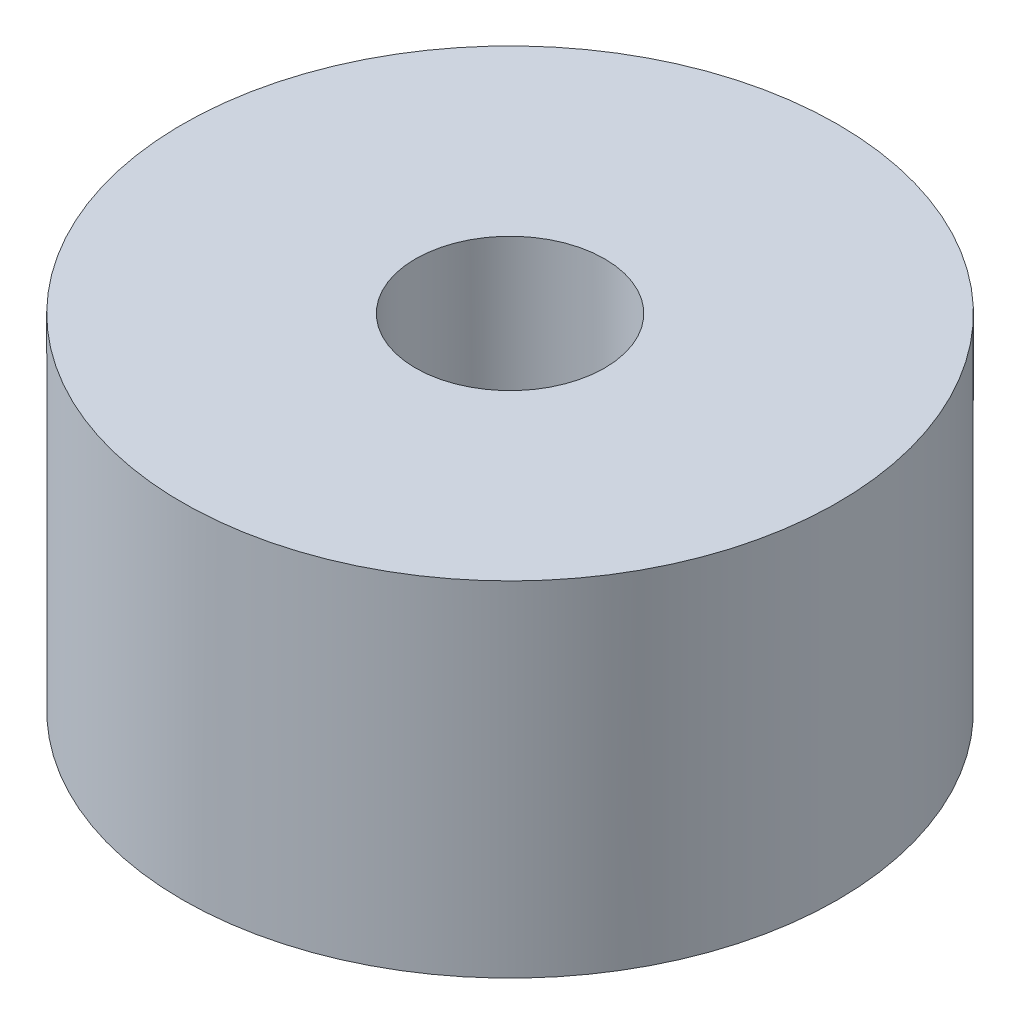
ISO-10303-21;
HEADER;
FILE_DESCRIPTION(('STEP AP214'),'2;1');
FILE_NAME('part.step','',(''),(''),'','','');
FILE_SCHEMA(('AUTOMOTIVE_DESIGN { 1 0 10303 214 1 1 1 1 }'));
ENDSEC;
DATA;
#1=APPLICATION_CONTEXT('core data for automotive mechanical design processes');
#2=APPLICATION_PROTOCOL_DEFINITION('international standard','automotive_design',2000,#1);
#3=PRODUCT_CONTEXT('',#1,'mechanical');
#4=PRODUCT('Part','Part','',(#3));
#5=PRODUCT_RELATED_PRODUCT_CATEGORY('part','',(#4));
#6=PRODUCT_DEFINITION_FORMATION('','',#4);
#7=PRODUCT_DEFINITION_CONTEXT('part definition',#1,'design');
#8=PRODUCT_DEFINITION('design','',#6,#7);
#9=PRODUCT_DEFINITION_SHAPE('','',#8);
#10=(LENGTH_UNIT() NAMED_UNIT(*) SI_UNIT(.MILLI.,.METRE.));
#11=(NAMED_UNIT(*) PLANE_ANGLE_UNIT() SI_UNIT($,.RADIAN.));
#12=(NAMED_UNIT(*) SI_UNIT($,.STERADIAN.) SOLID_ANGLE_UNIT());
#13=UNCERTAINTY_MEASURE_WITH_UNIT(LENGTH_MEASURE(1.E-05),#10,'distance_accuracy_value','');
#14=(GEOMETRIC_REPRESENTATION_CONTEXT(3) GLOBAL_UNCERTAINTY_ASSIGNED_CONTEXT((#13)) GLOBAL_UNIT_ASSIGNED_CONTEXT((#10,
#11,#12)) REPRESENTATION_CONTEXT('',''));
#15=CARTESIAN_POINT('',(0.,0.,0.));
#16=DIRECTION('',(0.,0.,1.));
#17=DIRECTION('',(1.,0.,0.));
#18=AXIS2_PLACEMENT_3D('',#15,#16,#17);
#19=CARTESIAN_POINT('',(0.,10.,0.));
#20=DIRECTION('',(0.,-1.,0.));
#21=DIRECTION('',(0.,0.,-1.));
#22=AXIS2_PLACEMENT_3D('',#19,#20,#21);
#23=PLANE('',#22);
#24=CARTESIAN_POINT('',(0.,10.,0.));
#25=DIRECTION('',(0.,-1.,0.));
#26=DIRECTION('',(0.,0.,-1.));
#27=AXIS2_PLACEMENT_3D('',#24,#25,#26);
#28=CIRCLE('',#27,2.75);
#29=CARTESIAN_POINT('',(0.,10.,-2.75));
#30=VERTEX_POINT('',#29);
#31=EDGE_CURVE('E50',#30,#30,#28,.T.);
#32=ORIENTED_EDGE('',*,*,#31,.T.);
#33=EDGE_LOOP('',(#32));
#34=FACE_BOUND('',#33,.T.);
#35=CARTESIAN_POINT('',(0.,10.,0.));
#36=DIRECTION('',(0.,-1.,0.));
#37=DIRECTION('',(0.,0.,-1.));
#38=AXIS2_PLACEMENT_3D('',#35,#36,#37);
#39=CIRCLE('',#38,9.525);
#40=CARTESIAN_POINT('',(0.,10.,-9.525));
#41=VERTEX_POINT('',#40);
#42=EDGE_CURVE('E46',#41,#41,#39,.T.);
#43=ORIENTED_EDGE('',*,*,#42,.F.);
#44=EDGE_LOOP('',(#43));
#45=FACE_BOUND('',#44,.T.);
#46=ADVANCED_FACE('F35',(#34,#45),#23,.F.);
#47=CARTESIAN_POINT('',(0.,1.,0.));
#48=DIRECTION('',(0.,-1.,0.));
#49=DIRECTION('',(0.,0.,-1.));
#50=AXIS2_PLACEMENT_3D('',#47,#48,#49);
#51=CYLINDRICAL_SURFACE('',#50,9.525);
#52=CARTESIAN_POINT('',(0.,0.,0.));
#53=DIRECTION('',(0.,1.,0.));
#54=DIRECTION('',(0.,0.,1.));
#55=AXIS2_PLACEMENT_3D('',#52,#53,#54);
#56=CIRCLE('',#55,9.525);
#57=CARTESIAN_POINT('',(0.,0.,9.525));
#58=VERTEX_POINT('',#57);
#59=EDGE_CURVE('E10',#58,#58,#56,.T.);
#60=ORIENTED_EDGE('',*,*,#59,.T.);
#61=EDGE_LOOP('',(#60));
#62=FACE_BOUND('',#61,.T.);
#63=ORIENTED_EDGE('',*,*,#42,.T.);
#64=EDGE_LOOP('',(#63));
#65=FACE_BOUND('',#64,.T.);
#66=ADVANCED_FACE('F37',(#62,#65),#51,.T.);
#67=CARTESIAN_POINT('',(0.,0.,0.));
#68=DIRECTION('',(0.,1.,0.));
#69=DIRECTION('',(0.,0.,1.));
#70=AXIS2_PLACEMENT_3D('',#67,#68,#69);
#71=PLANE('',#70);
#72=CARTESIAN_POINT('',(0.,0.,0.));
#73=DIRECTION('',(0.,1.,0.));
#74=DIRECTION('',(0.,0.,1.));
#75=AXIS2_PLACEMENT_3D('',#72,#73,#74);
#76=CIRCLE('',#75,2.75);
#77=CARTESIAN_POINT('',(0.,0.,2.75));
#78=VERTEX_POINT('',#77);
#79=EDGE_CURVE('E42',#78,#78,#76,.T.);
#80=ORIENTED_EDGE('',*,*,#79,.T.);
#81=EDGE_LOOP('',(#80));
#82=FACE_BOUND('',#81,.T.);
#83=ORIENTED_EDGE('',*,*,#59,.F.);
#84=EDGE_LOOP('',(#83));
#85=FACE_BOUND('',#84,.T.);
#86=ADVANCED_FACE('F60',(#82,#85),#71,.F.);
#87=CARTESIAN_POINT('',(0.,1.,0.));
#88=DIRECTION('',(0.,1.,0.));
#89=DIRECTION('',(0.,0.,1.));
#90=AXIS2_PLACEMENT_3D('',#87,#88,#89);
#91=CYLINDRICAL_SURFACE('',#90,2.74999999999999);
#92=ORIENTED_EDGE('',*,*,#79,.F.);
#93=EDGE_LOOP('',(#92));
#94=FACE_BOUND('',#93,.T.);
#95=ORIENTED_EDGE('',*,*,#31,.F.);
#96=EDGE_LOOP('',(#95));
#97=FACE_BOUND('',#96,.T.);
#98=ADVANCED_FACE('F58',(#94,#97),#91,.F.);
#99=CLOSED_SHELL('',(#46,#66,#86,#98));
#100=MANIFOLD_SOLID_BREP('B2',#99);
#101=ADVANCED_BREP_SHAPE_REPRESENTATION('',(#18,#100),#14);
#102=SHAPE_DEFINITION_REPRESENTATION(#9,#101);
ENDSEC;
END-ISO-10303-21;
